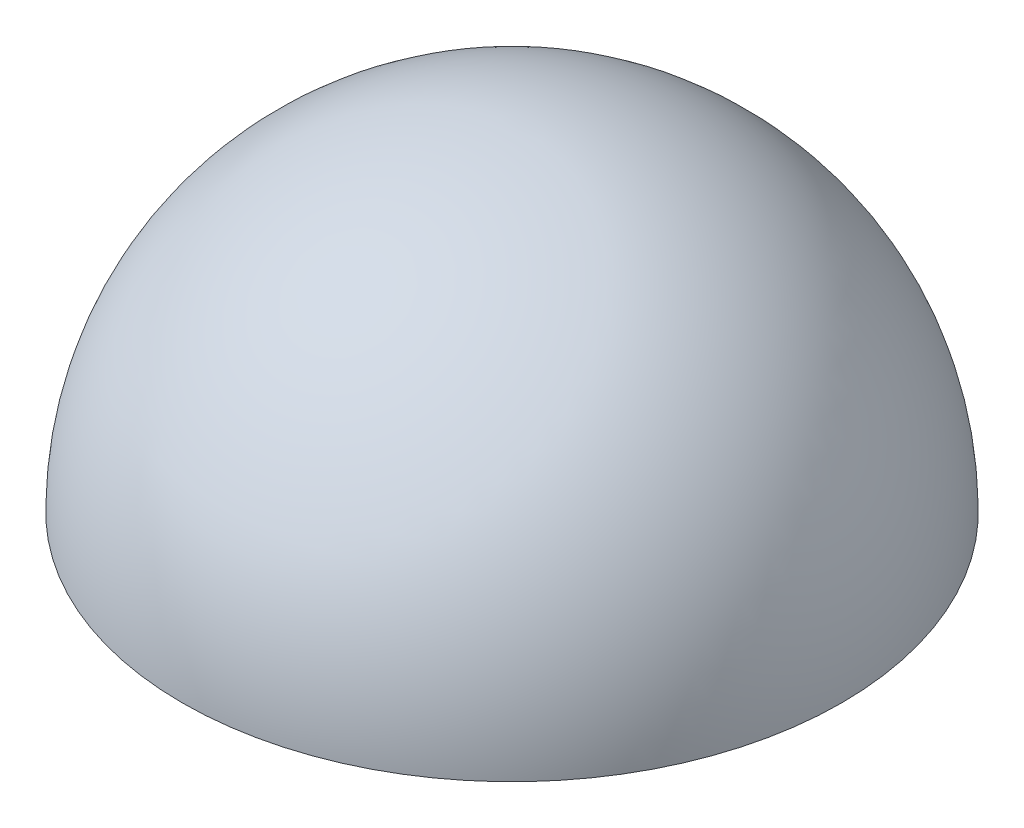
ISO-10303-21;
HEADER;
FILE_DESCRIPTION(('STEP AP214'),'2;1');
FILE_NAME('part.step','',(''),(''),'','','');
FILE_SCHEMA(('AUTOMOTIVE_DESIGN { 1 0 10303 214 1 1 1 1 }'));
ENDSEC;
DATA;
#1=APPLICATION_CONTEXT('core data for automotive mechanical design processes');
#2=APPLICATION_PROTOCOL_DEFINITION('international standard','automotive_design',2000,#1);
#3=PRODUCT_CONTEXT('',#1,'mechanical');
#4=PRODUCT('Part','Part','',(#3));
#5=PRODUCT_RELATED_PRODUCT_CATEGORY('part','',(#4));
#6=PRODUCT_DEFINITION_FORMATION('','',#4);
#7=PRODUCT_DEFINITION_CONTEXT('part definition',#1,'design');
#8=PRODUCT_DEFINITION('design','',#6,#7);
#9=PRODUCT_DEFINITION_SHAPE('','',#8);
#10=(LENGTH_UNIT() NAMED_UNIT(*) SI_UNIT(.MILLI.,.METRE.));
#11=(NAMED_UNIT(*) PLANE_ANGLE_UNIT() SI_UNIT($,.RADIAN.));
#12=(NAMED_UNIT(*) SI_UNIT($,.STERADIAN.) SOLID_ANGLE_UNIT());
#13=UNCERTAINTY_MEASURE_WITH_UNIT(LENGTH_MEASURE(1.E-05),#10,'distance_accuracy_value','');
#14=(GEOMETRIC_REPRESENTATION_CONTEXT(3) GLOBAL_UNCERTAINTY_ASSIGNED_CONTEXT((#13)) GLOBAL_UNIT_ASSIGNED_CONTEXT((#10,
#11,#12)) REPRESENTATION_CONTEXT('',''));
#15=CARTESIAN_POINT('',(0.,0.,0.));
#16=DIRECTION('',(0.,0.,1.));
#17=DIRECTION('',(1.,0.,0.));
#18=AXIS2_PLACEMENT_3D('',#15,#16,#17);
#19=CARTESIAN_POINT('',(0.,0.,0.));
#20=DIRECTION('',(0.,1.,0.));
#21=DIRECTION('',(1.,0.,0.));
#22=AXIS2_PLACEMENT_3D('',#19,#20,#21);
#23=SPHERICAL_SURFACE('',#22,5.);
#24=CARTESIAN_POINT('',(0.,0.,0.));
#25=DIRECTION('',(0.,1.,0.));
#26=DIRECTION('',(0.,0.,1.));
#27=AXIS2_PLACEMENT_3D('',#24,#25,#26);
#28=CIRCLE('',#27,5.);
#29=CARTESIAN_POINT('',(0.,0.,5.));
#30=VERTEX_POINT('',#29);
#31=EDGE_CURVE('E10',#30,#30,#28,.T.);
#32=ORIENTED_EDGE('',*,*,#31,.T.);
#33=EDGE_LOOP('',(#32));
#34=FACE_BOUND('',#33,.T.);
#35=ADVANCED_FACE('F32',(#34),#23,.T.);
#36=CARTESIAN_POINT('',(0.,0.,0.));
#37=DIRECTION('',(0.,1.,0.));
#38=DIRECTION('',(0.,0.,1.));
#39=AXIS2_PLACEMENT_3D('',#36,#37,#38);
#40=PLANE('',#39);
#41=ORIENTED_EDGE('',*,*,#31,.F.);
#42=EDGE_LOOP('',(#41));
#43=FACE_BOUND('',#42,.T.);
#44=ADVANCED_FACE('F40',(#43),#40,.F.);
#45=CLOSED_SHELL('',(#35,#44));
#46=MANIFOLD_SOLID_BREP('B2',#45);
#47=ADVANCED_BREP_SHAPE_REPRESENTATION('',(#18,#46),#14);
#48=SHAPE_DEFINITION_REPRESENTATION(#9,#47);
ENDSEC;
END-ISO-10303-21;
